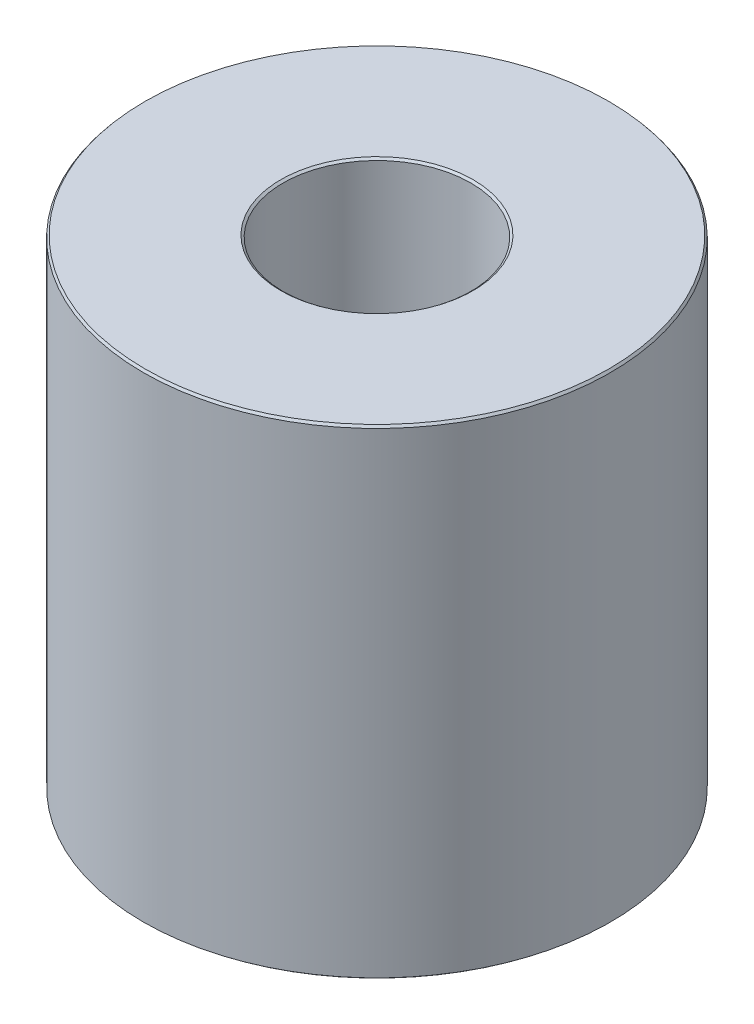
ISO-10303-21;
HEADER;
FILE_DESCRIPTION(('STEP AP214'),'2;1');
FILE_NAME('part.step','',(''),(''),'','','');
FILE_SCHEMA(('AUTOMOTIVE_DESIGN { 1 0 10303 214 1 1 1 1 }'));
ENDSEC;
DATA;
#1=APPLICATION_CONTEXT('core data for automotive mechanical design processes');
#2=APPLICATION_PROTOCOL_DEFINITION('international standard','automotive_design',2000,#1);
#3=PRODUCT_CONTEXT('',#1,'mechanical');
#4=PRODUCT('Part','Part','',(#3));
#5=PRODUCT_RELATED_PRODUCT_CATEGORY('part','',(#4));
#6=PRODUCT_DEFINITION_FORMATION('','',#4);
#7=PRODUCT_DEFINITION_CONTEXT('part definition',#1,'design');
#8=PRODUCT_DEFINITION('design','',#6,#7);
#9=PRODUCT_DEFINITION_SHAPE('','',#8);
#10=(LENGTH_UNIT() NAMED_UNIT(*) SI_UNIT(.MILLI.,.METRE.));
#11=(NAMED_UNIT(*) PLANE_ANGLE_UNIT() SI_UNIT($,.RADIAN.));
#12=(NAMED_UNIT(*) SI_UNIT($,.STERADIAN.) SOLID_ANGLE_UNIT());
#13=UNCERTAINTY_MEASURE_WITH_UNIT(LENGTH_MEASURE(1.E-05),#10,'distance_accuracy_value','');
#14=(GEOMETRIC_REPRESENTATION_CONTEXT(3) GLOBAL_UNCERTAINTY_ASSIGNED_CONTEXT((#13)) GLOBAL_UNIT_ASSIGNED_CONTEXT((#10,
#11,#12)) REPRESENTATION_CONTEXT('',''));
#15=CARTESIAN_POINT('',(0.,0.,0.));
#16=DIRECTION('',(0.,0.,1.));
#17=DIRECTION('',(1.,0.,0.));
#18=AXIS2_PLACEMENT_3D('',#15,#16,#17);
#19=CARTESIAN_POINT('',(0.,66.7669262287773,0.));
#20=DIRECTION('',(0.,-1.,0.));
#21=DIRECTION('',(0.,0.,-1.));
#22=AXIS2_PLACEMENT_3D('',#19,#20,#21);
#23=CYLINDRICAL_SURFACE('',#22,32.5);
#24=CARTESIAN_POINT('',(0.,0.245177629049534,0.));
#25=DIRECTION('',(0.,1.,0.));
#26=DIRECTION('',(0.,0.,1.));
#27=AXIS2_PLACEMENT_3D('',#24,#25,#26);
#28=CIRCLE('',#27,32.5);
#29=CARTESIAN_POINT('',(0.,0.245177629049534,32.5));
#30=VERTEX_POINT('',#29);
#31=EDGE_CURVE('E10',#30,#30,#28,.T.);
#32=ORIENTED_EDGE('',*,*,#31,.T.);
#33=EDGE_LOOP('',(#32));
#34=FACE_BOUND('',#33,.T.);
#35=CARTESIAN_POINT('',(0.,66.453314762179,0.));
#36=DIRECTION('',(0.,1.,0.));
#37=DIRECTION('',(0.,0.,1.));
#38=AXIS2_PLACEMENT_3D('',#35,#36,#37);
#39=CIRCLE('',#38,32.5);
#40=CARTESIAN_POINT('',(0.,66.453314762179,32.5));
#41=VERTEX_POINT('',#40);
#42=EDGE_CURVE('E50',#41,#41,#39,.F.);
#43=ORIENTED_EDGE('',*,*,#42,.T.);
#44=EDGE_LOOP('',(#43));
#45=FACE_BOUND('',#44,.T.);
#46=ADVANCED_FACE('F39',(#34,#45),#23,.T.);
#47=CARTESIAN_POINT('',(0.,66.7669262287773,0.));
#48=DIRECTION('',(0.,1.,0.));
#49=DIRECTION('',(0.,0.,1.));
#50=AXIS2_PLACEMENT_3D('',#47,#48,#49);
#51=PLANE('',#50);
#52=CARTESIAN_POINT('',(0.,66.7669262287773,0.));
#53=DIRECTION('',(0.,1.,0.));
#54=DIRECTION('',(0.,0.,1.));
#55=AXIS2_PLACEMENT_3D('',#52,#53,#54);
#56=CIRCLE('',#55,13.3837646051392);
#57=CARTESIAN_POINT('',(0.,66.7669262287773,13.3837646051392));
#58=VERTEX_POINT('',#57);
#59=EDGE_CURVE('E58',#58,#58,#56,.F.);
#60=ORIENTED_EDGE('',*,*,#59,.T.);
#61=EDGE_LOOP('',(#60));
#62=FACE_BOUND('',#61,.T.);
#63=CARTESIAN_POINT('',(0.,66.7669262287773,0.));
#64=DIRECTION('',(0.,1.,0.));
#65=DIRECTION('',(0.,0.,1.));
#66=AXIS2_PLACEMENT_3D('',#63,#64,#65);
#67=CIRCLE('',#66,32.2548223709505);
#68=CARTESIAN_POINT('',(0.,66.7669262287773,32.2548223709505));
#69=VERTEX_POINT('',#68);
#70=EDGE_CURVE('E61',#69,#69,#67,.T.);
#71=ORIENTED_EDGE('',*,*,#70,.T.);
#72=EDGE_LOOP('',(#71));
#73=FACE_BOUND('',#72,.T.);
#74=ADVANCED_FACE('F88',(#62,#73),#51,.T.);
#75=CARTESIAN_POINT('',(0.,0.,0.));
#76=DIRECTION('',(0.,1.,0.));
#77=DIRECTION('',(0.,0.,1.));
#78=AXIS2_PLACEMENT_3D('',#75,#76,#77);
#79=PLANE('',#78);
#80=CARTESIAN_POINT('',(0.,0.,0.));
#81=DIRECTION('',(0.,1.,0.));
#82=DIRECTION('',(0.,0.,1.));
#83=AXIS2_PLACEMENT_3D('',#80,#81,#82);
#84=CIRCLE('',#83,13.3153307675905);
#85=CARTESIAN_POINT('',(0.,0.,-13.3153307675905));
#86=VERTEX_POINT('',#85);
#87=EDGE_CURVE('E51',#86,#86,#84,.T.);
#88=ORIENTED_EDGE('',*,*,#87,.T.);
#89=EDGE_LOOP('',(#88));
#90=FACE_BOUND('',#89,.T.);
#91=CARTESIAN_POINT('',(0.,0.,0.));
#92=DIRECTION('',(0.,1.,0.));
#93=DIRECTION('',(0.,0.,1.));
#94=AXIS2_PLACEMENT_3D('',#91,#92,#93);
#95=CIRCLE('',#94,32.1863885334017);
#96=CARTESIAN_POINT('',(0.,0.,32.1863885334017));
#97=VERTEX_POINT('',#96);
#98=EDGE_CURVE('E54',#97,#97,#95,.F.);
#99=ORIENTED_EDGE('',*,*,#98,.T.);
#100=EDGE_LOOP('',(#99));
#101=FACE_BOUND('',#100,.T.);
#102=ADVANCED_FACE('F83',(#90,#101),#79,.F.);
#103=CARTESIAN_POINT('',(0.,66.7669262287773,0.));
#104=DIRECTION('',(0.,-1.,0.));
#105=DIRECTION('',(0.,0.,-1.));
#106=AXIS2_PLACEMENT_3D('',#103,#104,#105);
#107=CYLINDRICAL_SURFACE('',#106,13.070153138541);
#108=CARTESIAN_POINT('',(0.,66.5217485997277,0.));
#109=DIRECTION('',(0.,1.,0.));
#110=DIRECTION('',(0.,0.,1.));
#111=AXIS2_PLACEMENT_3D('',#108,#109,#110);
#112=CIRCLE('',#111,13.070153138541);
#113=CARTESIAN_POINT('',(0.,66.5217485997277,13.070153138541));
#114=VERTEX_POINT('',#113);
#115=EDGE_CURVE('E67',#114,#114,#112,.T.);
#116=ORIENTED_EDGE('',*,*,#115,.T.);
#117=EDGE_LOOP('',(#116));
#118=FACE_BOUND('',#117,.T.);
#119=CARTESIAN_POINT('',(0.,0.313611466598265,0.));
#120=DIRECTION('',(0.,1.,0.));
#121=DIRECTION('',(0.,0.,1.));
#122=AXIS2_PLACEMENT_3D('',#119,#120,#121);
#123=CIRCLE('',#122,13.070153138541);
#124=CARTESIAN_POINT('',(0.,0.313611466598265,-13.070153138541));
#125=VERTEX_POINT('',#124);
#126=EDGE_CURVE('E69',#125,#125,#123,.F.);
#127=ORIENTED_EDGE('',*,*,#126,.T.);
#128=EDGE_LOOP('',(#127));
#129=FACE_BOUND('',#128,.T.);
#130=ADVANCED_FACE('F71',(#118,#129),#107,.F.);
#131=CARTESIAN_POINT('',(0.,66.5217485997277,0.));
#132=DIRECTION('',(0.,1.,0.));
#133=DIRECTION('',(0.,0.,1.));
#134=AXIS2_PLACEMENT_3D('',#131,#132,#133);
#135=CONICAL_SURFACE('',#134,13.070153138541,0.907259436045395);
#136=ORIENTED_EDGE('',*,*,#59,.F.);
#137=EDGE_LOOP('',(#136));
#138=FACE_BOUND('',#137,.T.);
#139=ORIENTED_EDGE('',*,*,#115,.F.);
#140=EDGE_LOOP('',(#139));
#141=FACE_BOUND('',#140,.T.);
#142=ADVANCED_FACE('F77',(#138,#141),#135,.F.);
#143=CARTESIAN_POINT('',(0.,0.,0.));
#144=DIRECTION('',(0.,-1.,0.));
#145=DIRECTION('',(0.,0.,-1.));
#146=AXIS2_PLACEMENT_3D('',#143,#144,#145);
#147=CONICAL_SURFACE('',#146,13.3153307675905,0.663536890749512);
#148=CARTESIAN_POINT('',(0.,0.313611466598265,-13.070153138541));
#149=CARTESIAN_POINT('',(0.,0.310344680487867,-13.0727070721769));
#150=CARTESIAN_POINT('',(0.,0.307077894377468,-13.0752610058128));
#151=CARTESIAN_POINT('',(0.,0.300544322156671,-13.0803688730847));
#152=CARTESIAN_POINT('',(0.,0.297277536046272,-13.0829228067206));
#153=CARTESIAN_POINT('',(0.,0.290743963825475,-13.0880306739925));
#154=CARTESIAN_POINT('',(0.,0.287477177715076,-13.0905846076284));
#155=CARTESIAN_POINT('',(0.,0.280943605494279,-13.0956924749003));
#156=CARTESIAN_POINT('',(0.,0.277676819383881,-13.0982464085362));
#157=CARTESIAN_POINT('',(0.,0.271143247163084,-13.1033542758081));
#158=CARTESIAN_POINT('',(0.,0.267876461052685,-13.105908209444));
#159=CARTESIAN_POINT('',(0.,0.261342888831888,-13.1110160767159));
#160=CARTESIAN_POINT('',(0.,0.258076102721489,-13.1135700103518));
#161=CARTESIAN_POINT('',(0.,0.251542530500692,-13.1186778776237));
#162=CARTESIAN_POINT('',(0.,0.248275744390293,-13.1212318112596));
#163=CARTESIAN_POINT('',(0.,0.241742172169496,-13.1263396785315));
#164=CARTESIAN_POINT('',(0.,0.238475386059098,-13.1288936121674));
#165=CARTESIAN_POINT('',(0.,0.2319418138383,-13.1340014794393));
#166=CARTESIAN_POINT('',(0.,0.228675027727902,-13.1365554130752));
#167=CARTESIAN_POINT('',(0.,0.222141455507104,-13.1416632803471));
#168=CARTESIAN_POINT('',(0.,0.218874669396706,-13.144217213983));
#169=CARTESIAN_POINT('',(0.,0.212341097175909,-13.1493250812549));
#170=CARTESIAN_POINT('',(0.,0.20907431106551,-13.1518790148908));
#171=CARTESIAN_POINT('',(0.,0.202540738844713,-13.1569868821627));
#172=CARTESIAN_POINT('',(0.,0.199273952734314,-13.1595408157986));
#173=CARTESIAN_POINT('',(0.,0.192740380513517,-13.1646486830705));
#174=CARTESIAN_POINT('',(0.,0.189473594403119,-13.1672026167064));
#175=CARTESIAN_POINT('',(0.,0.182940022182321,-13.1723104839783));
#176=CARTESIAN_POINT('',(0.,0.179673236071923,-13.1748644176142));
#177=CARTESIAN_POINT('',(0.,0.173139663851126,-13.1799722848861));
#178=CARTESIAN_POINT('',(0.,0.169872877740727,-13.182526218522));
#179=CARTESIAN_POINT('',(0.,0.16333930551993,-13.1876340857939));
#180=CARTESIAN_POINT('',(0.,0.160072519409531,-13.1901880194298));
#181=CARTESIAN_POINT('',(0.,0.153538947188734,-13.1952958867017));
#182=CARTESIAN_POINT('',(0.,0.150272161078336,-13.1978498203376));
#183=CARTESIAN_POINT('',(0.,0.143738588857538,-13.2029576876095));
#184=CARTESIAN_POINT('',(0.,0.14047180274714,-13.2055116212454));
#185=CARTESIAN_POINT('',(0.,0.133938230526342,-13.2106194885173));
#186=CARTESIAN_POINT('',(0.,0.130671444415944,-13.2131734221532));
#187=CARTESIAN_POINT('',(0.,0.124137872195147,-13.2182812894251));
#188=CARTESIAN_POINT('',(0.,0.120871086084748,-13.220835223061));
#189=CARTESIAN_POINT('',(0.,0.114337513863951,-13.2259430903329));
#190=CARTESIAN_POINT('',(0.,0.111070727753552,-13.2284970239688));
#191=CARTESIAN_POINT('',(0.,0.104537155532755,-13.2336048912407));
#192=CARTESIAN_POINT('',(0.,0.101270369422356,-13.2361588248766));
#193=CARTESIAN_POINT('',(0.,0.0947367972015594,-13.2412666921485));
#194=CARTESIAN_POINT('',(0.,0.0914700110911609,-13.2438206257844));
#195=CARTESIAN_POINT('',(0.,0.0849364388703636,-13.2489284930563));
#196=CARTESIAN_POINT('',(0.,0.0816696527599648,-13.2514824266922));
#197=CARTESIAN_POINT('',(0.,0.0751360805391676,-13.2565902939641));
#198=CARTESIAN_POINT('',(0.,0.0718692944287691,-13.2591442276));
#199=CARTESIAN_POINT('',(0.,0.065335722207972,-13.2642520948719));
#200=CARTESIAN_POINT('',(0.,0.0620689360975733,-13.2668060285078));
#201=CARTESIAN_POINT('',(0.,0.0555353638767762,-13.2719138957797));
#202=CARTESIAN_POINT('',(0.,0.0522685777663777,-13.2744678294156));
#203=CARTESIAN_POINT('',(0.,0.0457350055455805,-13.2795756966875));
#204=CARTESIAN_POINT('',(0.,0.0424682194351817,-13.2821296303234));
#205=CARTESIAN_POINT('',(0.,0.0359346472143844,-13.2872374975953));
#206=CARTESIAN_POINT('',(0.,0.0326678611039859,-13.2897914312312));
#207=CARTESIAN_POINT('',(0.,0.0261342888831889,-13.2948992985031));
#208=CARTESIAN_POINT('',(0.,0.0228675027727903,-13.297453232139));
#209=CARTESIAN_POINT('',(0.,0.0163339305519931,-13.3025610994109));
#210=CARTESIAN_POINT('',(0.,0.0130671444415944,-13.3051150330468));
#211=CARTESIAN_POINT('',(0.,0.00653357222079692,-13.3102229003187));
#212=CARTESIAN_POINT('',(0.,0.0032667861103982,-13.3127768339546));
#213=CARTESIAN_POINT('',(0.,0.,-13.3153307675905));
#214=B_SPLINE_CURVE_WITH_KNOTS('',3,(#148,#149,#150,#151,#152,#153,#154,#155,#156,#157,#158,
#159,#160,#161,#162,#163,#164,#165,#166,#167,#168,#169,#170,#171,#172,#173,#174,#175,#176,#177,
#178,#179,#180,#181,#182,#183,#184,#185,#186,#187,#188,#189,#190,#191,#192,#193,#194,#195,#196,
#197,#198,#199,#200,#201,#202,#203,#204,#205,#206,#207,#208,#209,#210,#211,#212,#213),
.UNSPECIFIED.,.F.,.F.,(4,2,2,2,2,2,2,2,2,2,2,2,2,2,2,2,2,2,2,2,2,2,2,2,2,2,2,2,2,2,2,2,4),(0.,
0.0124398640093287,0.0248797280186564,0.0373195920279851,0.0497594560373138,0.0621993200466414,
0.0746391840559702,0.0870790480652989,0.0995189120746276,0.111958776083955,0.124398640093284,
0.136838504102613,0.14927836811194,0.161718232121269,0.174158096130598,0.186597960139925,
0.199037824149254,0.211477688158583,0.22391755216791,0.236357416177239,0.248797280186568,
0.261237144195896,0.273677008205224,0.286116872214553,0.298556736223881,0.310996600233209,
0.323436464242538,0.335876328251867,0.348316192261194,0.360756056270523,0.373195920279852,
0.385635784289179,0.398075648298508),.UNSPECIFIED.);
#215=EDGE_CURVE('BSEAM73',#125,#86,#214,.T.);
#216=ORIENTED_EDGE('',*,*,#126,.F.);
#217=ORIENTED_EDGE('',*,*,#87,.F.);
#218=ORIENTED_EDGE('',*,*,#215,.T.);
#219=ORIENTED_EDGE('',*,*,#215,.F.);
#220=EDGE_LOOP('',(#216,#218,#217,#219));
#221=FACE_BOUND('',#220,.T.);
#222=ADVANCED_FACE('F73',(#221),#147,.F.);
#223=CARTESIAN_POINT('',(0.,0.245177629049534,0.));
#224=DIRECTION('',(0.,1.,0.));
#225=DIRECTION('',(0.,0.,1.));
#226=AXIS2_PLACEMENT_3D('',#223,#224,#225);
#227=CONICAL_SURFACE('',#226,32.5,0.907259436045412);
#228=ORIENTED_EDGE('',*,*,#98,.F.);
#229=EDGE_LOOP('',(#228));
#230=FACE_BOUND('',#229,.T.);
#231=ORIENTED_EDGE('',*,*,#31,.F.);
#232=EDGE_LOOP('',(#231));
#233=FACE_BOUND('',#232,.T.);
#234=ADVANCED_FACE('F76',(#230,#233),#227,.T.);
#235=CARTESIAN_POINT('',(0.,66.7669262287773,0.));
#236=DIRECTION('',(0.,-1.,0.));
#237=DIRECTION('',(0.,0.,-1.));
#238=AXIS2_PLACEMENT_3D('',#235,#236,#237);
#239=CONICAL_SURFACE('',#238,32.2548223709505,0.663536890749458);
#240=ORIENTED_EDGE('',*,*,#42,.F.);
#241=EDGE_LOOP('',(#240));
#242=FACE_BOUND('',#241,.T.);
#243=ORIENTED_EDGE('',*,*,#70,.F.);
#244=EDGE_LOOP('',(#243));
#245=FACE_BOUND('',#244,.T.);
#246=ADVANCED_FACE('F45',(#242,#245),#239,.T.);
#247=CLOSED_SHELL('',(#46,#74,#102,#130,#142,#222,#234,#246));
#248=MANIFOLD_SOLID_BREP('B2',#247);
#249=ADVANCED_BREP_SHAPE_REPRESENTATION('',(#18,#248),#14);
#250=SHAPE_DEFINITION_REPRESENTATION(#9,#249);
ENDSEC;
END-ISO-10303-21;
